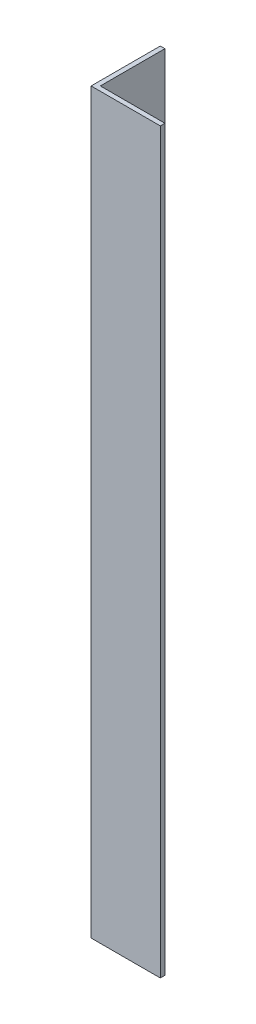
ISO-10303-21;
HEADER;
FILE_DESCRIPTION(('STEP AP214'),'2;1');
FILE_NAME('part.step','',(''),(''),'','','');
FILE_SCHEMA(('AUTOMOTIVE_DESIGN { 1 0 10303 214 1 1 1 1 }'));
ENDSEC;
DATA;
#1=APPLICATION_CONTEXT('core data for automotive mechanical design processes');
#2=APPLICATION_PROTOCOL_DEFINITION('international standard','automotive_design',2000,#1);
#3=PRODUCT_CONTEXT('',#1,'mechanical');
#4=PRODUCT('Part','Part','',(#3));
#5=PRODUCT_RELATED_PRODUCT_CATEGORY('part','',(#4));
#6=PRODUCT_DEFINITION_FORMATION('','',#4);
#7=PRODUCT_DEFINITION_CONTEXT('part definition',#1,'design');
#8=PRODUCT_DEFINITION('design','',#6,#7);
#9=PRODUCT_DEFINITION_SHAPE('','',#8);
#10=(LENGTH_UNIT() NAMED_UNIT(*) SI_UNIT(.MILLI.,.METRE.));
#11=(NAMED_UNIT(*) PLANE_ANGLE_UNIT() SI_UNIT($,.RADIAN.));
#12=(NAMED_UNIT(*) SI_UNIT($,.STERADIAN.) SOLID_ANGLE_UNIT());
#13=UNCERTAINTY_MEASURE_WITH_UNIT(LENGTH_MEASURE(1.E-05),#10,'distance_accuracy_value','');
#14=(GEOMETRIC_REPRESENTATION_CONTEXT(3) GLOBAL_UNCERTAINTY_ASSIGNED_CONTEXT((#13)) GLOBAL_UNIT_ASSIGNED_CONTEXT((#10,
#11,#12)) REPRESENTATION_CONTEXT('',''));
#15=CARTESIAN_POINT('',(0.,0.,0.));
#16=DIRECTION('',(0.,0.,1.));
#17=DIRECTION('',(1.,0.,0.));
#18=AXIS2_PLACEMENT_3D('',#15,#16,#17);
#19=CARTESIAN_POINT('',(15.,160.,0.));
#20=DIRECTION('',(0.,0.,-1.));
#21=DIRECTION('',(-1.,0.,0.));
#22=AXIS2_PLACEMENT_3D('',#19,#20,#21);
#23=PLANE('',#22);
#24=DIRECTION('',(1.,0.,0.));
#25=VECTOR('',#24,1.);
#26=CARTESIAN_POINT('',(15.,0.,0.));
#27=LINE('',#26,#25);
#28=CARTESIAN_POINT('',(0.,0.,0.));
#29=VERTEX_POINT('',#28);
#30=CARTESIAN_POINT('',(15.,0.,0.));
#31=VERTEX_POINT('',#30);
#32=EDGE_CURVE('E118',#29,#31,#27,.T.);
#33=ORIENTED_EDGE('',*,*,#32,.T.);
#34=DIRECTION('',(0.,-1.,0.));
#35=VECTOR('',#34,1.);
#36=CARTESIAN_POINT('',(15.,160.,0.));
#37=LINE('',#36,#35);
#38=CARTESIAN_POINT('',(15.,160.,0.));
#39=VERTEX_POINT('',#38);
#40=EDGE_CURVE('E11',#39,#31,#37,.T.);
#41=ORIENTED_EDGE('',*,*,#40,.F.);
#42=DIRECTION('',(1.,0.,0.));
#43=VECTOR('',#42,1.);
#44=CARTESIAN_POINT('',(15.,160.,0.));
#45=LINE('',#44,#43);
#46=CARTESIAN_POINT('',(0.,160.,0.));
#47=VERTEX_POINT('',#46);
#48=EDGE_CURVE('E128',#47,#39,#45,.T.);
#49=ORIENTED_EDGE('',*,*,#48,.F.);
#50=DIRECTION('',(0.,-1.,0.));
#51=VECTOR('',#50,1.);
#52=CARTESIAN_POINT('',(0.,160.,0.));
#53=LINE('',#52,#51);
#54=EDGE_CURVE('E114',#47,#29,#53,.T.);
#55=ORIENTED_EDGE('',*,*,#54,.T.);
#56=EDGE_LOOP('',(#33,#41,#49,#55));
#57=FACE_BOUND('',#56,.T.);
#58=ADVANCED_FACE('F34',(#57),#23,.F.);
#59=CARTESIAN_POINT('',(15.,160.,-0.999999999999998));
#60=DIRECTION('',(-1.,0.,0.));
#61=DIRECTION('',(0.,0.,1.));
#62=AXIS2_PLACEMENT_3D('',#59,#60,#61);
#63=PLANE('',#62);
#64=DIRECTION('',(0.,0.,-1.));
#65=VECTOR('',#64,1.);
#66=CARTESIAN_POINT('',(15.,0.,-0.999999999999998));
#67=LINE('',#66,#65);
#68=CARTESIAN_POINT('',(15.,0.,-0.999999999999998));
#69=VERTEX_POINT('',#68);
#70=EDGE_CURVE('E121',#31,#69,#67,.T.);
#71=ORIENTED_EDGE('',*,*,#70,.T.);
#72=DIRECTION('',(0.,-1.,0.));
#73=VECTOR('',#72,1.);
#74=CARTESIAN_POINT('',(15.,160.,-0.999999999999998));
#75=LINE('',#74,#73);
#76=CARTESIAN_POINT('',(15.,160.,-0.999999999999998));
#77=VERTEX_POINT('',#76);
#78=EDGE_CURVE('E42',#77,#69,#75,.T.);
#79=ORIENTED_EDGE('',*,*,#78,.F.);
#80=DIRECTION('',(0.,0.,-1.));
#81=VECTOR('',#80,1.);
#82=CARTESIAN_POINT('',(15.,160.,-0.999999999999998));
#83=LINE('',#82,#81);
#84=EDGE_CURVE('E87',#39,#77,#83,.T.);
#85=ORIENTED_EDGE('',*,*,#84,.F.);
#86=ORIENTED_EDGE('',*,*,#40,.T.);
#87=EDGE_LOOP('',(#71,#79,#85,#86));
#88=FACE_BOUND('',#87,.T.);
#89=ADVANCED_FACE('F152',(#88),#63,.F.);
#90=CARTESIAN_POINT('',(1.,160.,-0.999999999999997));
#91=DIRECTION('',(0.,0.,1.));
#92=DIRECTION('',(1.,0.,0.));
#93=AXIS2_PLACEMENT_3D('',#90,#91,#92);
#94=PLANE('',#93);
#95=DIRECTION('',(-1.,0.,0.));
#96=VECTOR('',#95,1.);
#97=CARTESIAN_POINT('',(1.,0.,-0.999999999999997));
#98=LINE('',#97,#96);
#99=CARTESIAN_POINT('',(1.,0.,-0.999999999999997));
#100=VERTEX_POINT('',#99);
#101=EDGE_CURVE('E123',#69,#100,#98,.T.);
#102=ORIENTED_EDGE('',*,*,#101,.T.);
#103=DIRECTION('',(0.,-1.,0.));
#104=VECTOR('',#103,1.);
#105=CARTESIAN_POINT('',(1.,160.,-0.999999999999997));
#106=LINE('',#105,#104);
#107=CARTESIAN_POINT('',(1.,160.,-0.999999999999997));
#108=VERTEX_POINT('',#107);
#109=EDGE_CURVE('E109',#108,#100,#106,.T.);
#110=ORIENTED_EDGE('',*,*,#109,.F.);
#111=DIRECTION('',(-1.,0.,0.));
#112=VECTOR('',#111,1.);
#113=CARTESIAN_POINT('',(1.,160.,-0.999999999999997));
#114=LINE('',#113,#112);
#115=EDGE_CURVE('E100',#77,#108,#114,.T.);
#116=ORIENTED_EDGE('',*,*,#115,.F.);
#117=ORIENTED_EDGE('',*,*,#78,.T.);
#118=EDGE_LOOP('',(#102,#110,#116,#117));
#119=FACE_BOUND('',#118,.T.);
#120=ADVANCED_FACE('F134',(#119),#94,.F.);
#121=CARTESIAN_POINT('',(0.999999999999998,160.,-15.));
#122=DIRECTION('',(-1.,0.,0.));
#123=DIRECTION('',(0.,0.,1.));
#124=AXIS2_PLACEMENT_3D('',#121,#122,#123);
#125=PLANE('',#124);
#126=DIRECTION('',(0.,0.,-1.));
#127=VECTOR('',#126,1.);
#128=CARTESIAN_POINT('',(0.999999999999998,0.,-15.));
#129=LINE('',#128,#127);
#130=CARTESIAN_POINT('',(0.999999999999998,0.,-15.));
#131=VERTEX_POINT('',#130);
#132=EDGE_CURVE('E108',#100,#131,#129,.T.);
#133=ORIENTED_EDGE('',*,*,#132,.T.);
#134=DIRECTION('',(0.,-1.,0.));
#135=VECTOR('',#134,1.);
#136=CARTESIAN_POINT('',(0.999999999999998,160.,-15.));
#137=LINE('',#136,#135);
#138=CARTESIAN_POINT('',(0.999999999999998,160.,-15.));
#139=VERTEX_POINT('',#138);
#140=EDGE_CURVE('E105',#139,#131,#137,.T.);
#141=ORIENTED_EDGE('',*,*,#140,.F.);
#142=DIRECTION('',(0.,0.,-1.));
#143=VECTOR('',#142,1.);
#144=CARTESIAN_POINT('',(0.999999999999998,160.,-15.));
#145=LINE('',#144,#143);
#146=EDGE_CURVE('E94',#108,#139,#145,.T.);
#147=ORIENTED_EDGE('',*,*,#146,.F.);
#148=ORIENTED_EDGE('',*,*,#109,.T.);
#149=EDGE_LOOP('',(#133,#141,#147,#148));
#150=FACE_BOUND('',#149,.T.);
#151=ADVANCED_FACE('F106',(#150),#125,.F.);
#152=CARTESIAN_POINT('',(0.,160.,-15.));
#153=DIRECTION('',(0.,0.,1.));
#154=DIRECTION('',(1.,0.,0.));
#155=AXIS2_PLACEMENT_3D('',#152,#153,#154);
#156=PLANE('',#155);
#157=DIRECTION('',(-1.,0.,0.));
#158=VECTOR('',#157,1.);
#159=CARTESIAN_POINT('',(0.,0.,-15.));
#160=LINE('',#159,#158);
#161=CARTESIAN_POINT('',(0.,0.,-15.));
#162=VERTEX_POINT('',#161);
#163=EDGE_CURVE('E73',#131,#162,#160,.T.);
#164=ORIENTED_EDGE('',*,*,#163,.T.);
#165=DIRECTION('',(0.,-1.,0.));
#166=VECTOR('',#165,1.);
#167=CARTESIAN_POINT('',(0.,160.,-15.));
#168=LINE('',#167,#166);
#169=CARTESIAN_POINT('',(0.,160.,-15.));
#170=VERTEX_POINT('',#169);
#171=EDGE_CURVE('E110',#170,#162,#168,.T.);
#172=ORIENTED_EDGE('',*,*,#171,.F.);
#173=DIRECTION('',(-1.,0.,0.));
#174=VECTOR('',#173,1.);
#175=CARTESIAN_POINT('',(0.,160.,-15.));
#176=LINE('',#175,#174);
#177=EDGE_CURVE('E98',#139,#170,#176,.T.);
#178=ORIENTED_EDGE('',*,*,#177,.F.);
#179=ORIENTED_EDGE('',*,*,#140,.T.);
#180=EDGE_LOOP('',(#164,#172,#178,#179));
#181=FACE_BOUND('',#180,.T.);
#182=ADVANCED_FACE('F112',(#181),#156,.F.);
#183=CARTESIAN_POINT('',(0.,160.,0.));
#184=DIRECTION('',(1.,0.,0.));
#185=DIRECTION('',(0.,0.,-1.));
#186=AXIS2_PLACEMENT_3D('',#183,#184,#185);
#187=PLANE('',#186);
#188=DIRECTION('',(0.,0.,1.));
#189=VECTOR('',#188,1.);
#190=CARTESIAN_POINT('',(0.,0.,0.));
#191=LINE('',#190,#189);
#192=EDGE_CURVE('E79',#162,#29,#191,.T.);
#193=ORIENTED_EDGE('',*,*,#192,.T.);
#194=ORIENTED_EDGE('',*,*,#54,.F.);
#195=DIRECTION('',(0.,0.,1.));
#196=VECTOR('',#195,1.);
#197=CARTESIAN_POINT('',(0.,160.,0.));
#198=LINE('',#197,#196);
#199=EDGE_CURVE('E50',#170,#47,#198,.T.);
#200=ORIENTED_EDGE('',*,*,#199,.F.);
#201=ORIENTED_EDGE('',*,*,#171,.T.);
#202=EDGE_LOOP('',(#193,#194,#200,#201));
#203=FACE_BOUND('',#202,.T.);
#204=ADVANCED_FACE('F141',(#203),#187,.F.);
#205=CARTESIAN_POINT('',(0.,160.,0.));
#206=DIRECTION('',(0.,-1.,0.));
#207=DIRECTION('',(0.,0.,-1.));
#208=AXIS2_PLACEMENT_3D('',#205,#206,#207);
#209=PLANE('',#208);
#210=ORIENTED_EDGE('',*,*,#48,.T.);
#211=ORIENTED_EDGE('',*,*,#84,.T.);
#212=ORIENTED_EDGE('',*,*,#115,.T.);
#213=ORIENTED_EDGE('',*,*,#146,.T.);
#214=ORIENTED_EDGE('',*,*,#177,.T.);
#215=ORIENTED_EDGE('',*,*,#199,.T.);
#216=EDGE_LOOP('',(#210,#211,#212,#213,#214,#215));
#217=FACE_BOUND('',#216,.T.);
#218=ADVANCED_FACE('F96',(#217),#209,.F.);
#219=CARTESIAN_POINT('',(0.,0.,0.));
#220=DIRECTION('',(0.,-1.,0.));
#221=DIRECTION('',(0.,0.,-1.));
#222=AXIS2_PLACEMENT_3D('',#219,#220,#221);
#223=PLANE('',#222);
#224=ORIENTED_EDGE('',*,*,#32,.F.);
#225=ORIENTED_EDGE('',*,*,#192,.F.);
#226=ORIENTED_EDGE('',*,*,#163,.F.);
#227=ORIENTED_EDGE('',*,*,#132,.F.);
#228=ORIENTED_EDGE('',*,*,#101,.F.);
#229=ORIENTED_EDGE('',*,*,#70,.F.);
#230=EDGE_LOOP('',(#224,#225,#226,#227,#228,#229));
#231=FACE_BOUND('',#230,.T.);
#232=ADVANCED_FACE('F137',(#231),#223,.T.);
#233=CLOSED_SHELL('',(#58,#89,#120,#151,#182,#204,#218,#232));
#234=MANIFOLD_SOLID_BREP('B2',#233);
#235=ADVANCED_BREP_SHAPE_REPRESENTATION('',(#18,#234),#14);
#236=SHAPE_DEFINITION_REPRESENTATION(#9,#235);
ENDSEC;
END-ISO-10303-21;
